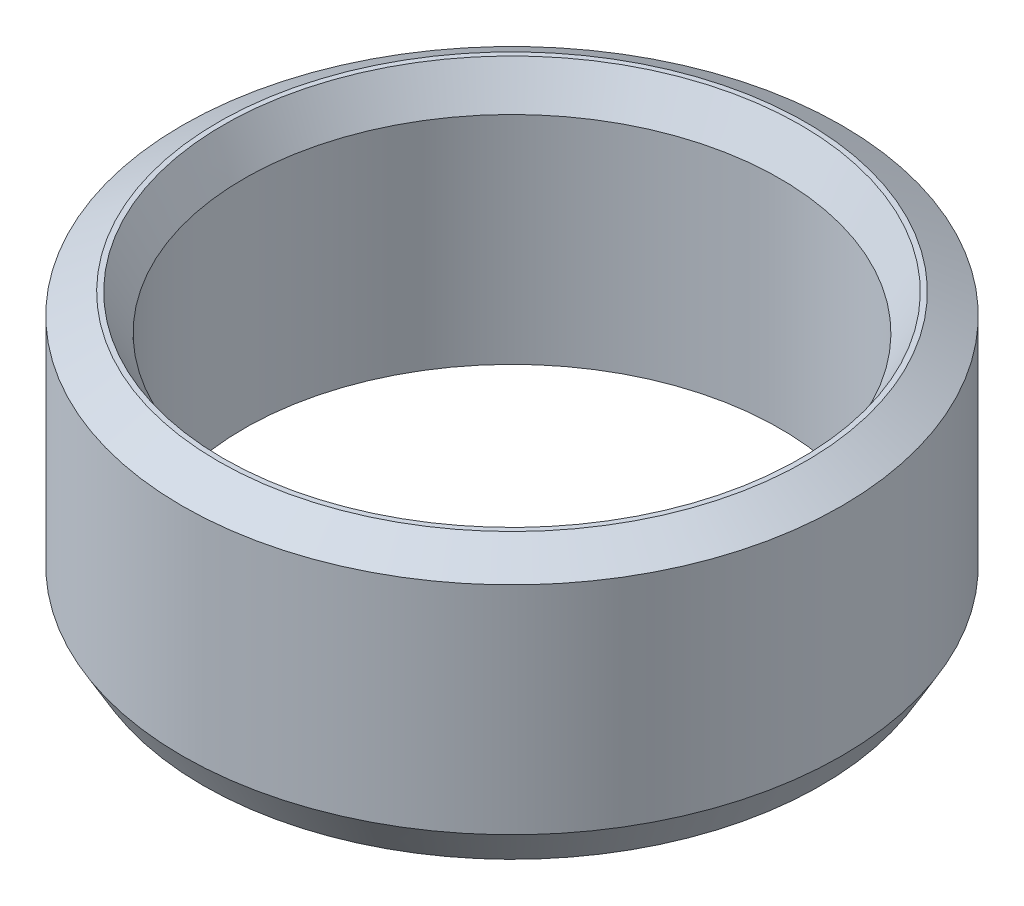
ISO-10303-21;
HEADER;
FILE_DESCRIPTION(('STEP AP214'),'2;1');
FILE_NAME('part.step','',(''),(''),'','','');
FILE_SCHEMA(('AUTOMOTIVE_DESIGN { 1 0 10303 214 1 1 1 1 }'));
ENDSEC;
DATA;
#1=APPLICATION_CONTEXT('core data for automotive mechanical design processes');
#2=APPLICATION_PROTOCOL_DEFINITION('international standard','automotive_design',2000,#1);
#3=PRODUCT_CONTEXT('',#1,'mechanical');
#4=PRODUCT('Part','Part','',(#3));
#5=PRODUCT_RELATED_PRODUCT_CATEGORY('part','',(#4));
#6=PRODUCT_DEFINITION_FORMATION('','',#4);
#7=PRODUCT_DEFINITION_CONTEXT('part definition',#1,'design');
#8=PRODUCT_DEFINITION('design','',#6,#7);
#9=PRODUCT_DEFINITION_SHAPE('','',#8);
#10=(LENGTH_UNIT() NAMED_UNIT(*) SI_UNIT(.MILLI.,.METRE.));
#11=(NAMED_UNIT(*) PLANE_ANGLE_UNIT() SI_UNIT($,.RADIAN.));
#12=(NAMED_UNIT(*) SI_UNIT($,.STERADIAN.) SOLID_ANGLE_UNIT());
#13=UNCERTAINTY_MEASURE_WITH_UNIT(LENGTH_MEASURE(1.E-05),#10,'distance_accuracy_value','');
#14=(GEOMETRIC_REPRESENTATION_CONTEXT(3) GLOBAL_UNCERTAINTY_ASSIGNED_CONTEXT((#13)) GLOBAL_UNIT_ASSIGNED_CONTEXT((#10,
#11,#12)) REPRESENTATION_CONTEXT('',''));
#15=CARTESIAN_POINT('',(0.,0.,0.));
#16=DIRECTION('',(0.,0.,1.));
#17=DIRECTION('',(1.,0.,0.));
#18=AXIS2_PLACEMENT_3D('',#15,#16,#17);
#19=CARTESIAN_POINT('',(0.,22.7844004385805,0.));
#20=DIRECTION('',(0.,-1.,0.));
#21=DIRECTION('',(0.,0.,-1.));
#22=AXIS2_PLACEMENT_3D('',#19,#20,#21);
#23=CYLINDRICAL_SURFACE('',#22,27.5);
#24=CARTESIAN_POINT('',(0.,3.00071029770119,0.));
#25=DIRECTION('',(0.,1.,0.));
#26=DIRECTION('',(0.,0.,1.));
#27=AXIS2_PLACEMENT_3D('',#24,#25,#26);
#28=CIRCLE('',#27,27.5);
#29=CARTESIAN_POINT('',(0.,3.00071029770119,27.5));
#30=VERTEX_POINT('',#29);
#31=EDGE_CURVE('E10',#30,#30,#28,.T.);
#32=ORIENTED_EDGE('',*,*,#31,.T.);
#33=EDGE_LOOP('',(#32));
#34=FACE_BOUND('',#33,.T.);
#35=CARTESIAN_POINT('',(0.,21.0519395404426,0.));
#36=DIRECTION('',(0.,1.,0.));
#37=DIRECTION('',(0.,0.,1.));
#38=AXIS2_PLACEMENT_3D('',#35,#36,#37);
#39=CIRCLE('',#38,27.5);
#40=CARTESIAN_POINT('',(0.,21.0519395404426,27.5));
#41=VERTEX_POINT('',#40);
#42=EDGE_CURVE('E50',#41,#41,#39,.F.);
#43=ORIENTED_EDGE('',*,*,#42,.T.);
#44=EDGE_LOOP('',(#43));
#45=FACE_BOUND('',#44,.T.);
#46=ADVANCED_FACE('F39',(#34,#45),#23,.T.);
#47=CARTESIAN_POINT('',(0.,22.7844004385805,0.));
#48=DIRECTION('',(0.,1.,0.));
#49=DIRECTION('',(0.,0.,1.));
#50=AXIS2_PLACEMENT_3D('',#47,#48,#49);
#51=PLANE('',#50);
#52=CARTESIAN_POINT('',(0.,22.7844004385805,0.));
#53=DIRECTION('',(0.,1.,0.));
#54=DIRECTION('',(0.,0.,1.));
#55=AXIS2_PLACEMENT_3D('',#52,#53,#54);
#56=CIRCLE('',#55,24.0819460958039);
#57=CARTESIAN_POINT('',(0.,22.7844004385805,24.0819460958039));
#58=VERTEX_POINT('',#57);
#59=EDGE_CURVE('E58',#58,#58,#56,.F.);
#60=ORIENTED_EDGE('',*,*,#59,.T.);
#61=EDGE_LOOP('',(#60));
#62=FACE_BOUND('',#61,.T.);
#63=CARTESIAN_POINT('',(0.,22.7844004385805,0.));
#64=DIRECTION('',(0.,1.,0.));
#65=DIRECTION('',(0.,0.,1.));
#66=AXIS2_PLACEMENT_3D('',#63,#64,#65);
#67=CIRCLE('',#66,24.4992897022988);
#68=CARTESIAN_POINT('',(0.,22.7844004385805,24.4992897022988));
#69=VERTEX_POINT('',#68);
#70=EDGE_CURVE('E61',#69,#69,#67,.T.);
#71=ORIENTED_EDGE('',*,*,#70,.T.);
#72=EDGE_LOOP('',(#71));
#73=FACE_BOUND('',#72,.T.);
#74=ADVANCED_FACE('F88',(#62,#73),#51,.T.);
#75=CARTESIAN_POINT('',(0.,0.,0.));
#76=DIRECTION('',(0.,1.,0.));
#77=DIRECTION('',(0.,0.,1.));
#78=AXIS2_PLACEMENT_3D('',#75,#76,#77);
#79=PLANE('',#78);
#80=CARTESIAN_POINT('',(0.,0.,0.));
#81=DIRECTION('',(0.,1.,0.));
#82=DIRECTION('',(0.,0.,1.));
#83=AXIS2_PLACEMENT_3D('',#80,#81,#82);
#84=CIRCLE('',#83,25.3501954953673);
#85=CARTESIAN_POINT('',(0.,0.,25.3501954953673));
#86=VERTEX_POINT('',#85);
#87=EDGE_CURVE('E51',#86,#86,#84,.T.);
#88=ORIENTED_EDGE('',*,*,#87,.T.);
#89=EDGE_LOOP('',(#88));
#90=FACE_BOUND('',#89,.T.);
#91=CARTESIAN_POINT('',(0.,0.,0.));
#92=DIRECTION('',(0.,1.,0.));
#93=DIRECTION('',(0.,0.,1.));
#94=AXIS2_PLACEMENT_3D('',#91,#92,#93);
#95=CIRCLE('',#94,25.7675391018621);
#96=CARTESIAN_POINT('',(0.,0.,25.7675391018621));
#97=VERTEX_POINT('',#96);
#98=EDGE_CURVE('E54',#97,#97,#95,.F.);
#99=ORIENTED_EDGE('',*,*,#98,.T.);
#100=EDGE_LOOP('',(#99));
#101=FACE_BOUND('',#100,.T.);
#102=ADVANCED_FACE('F83',(#90,#101),#79,.F.);
#103=CARTESIAN_POINT('',(0.,22.7844004385805,0.));
#104=DIRECTION('',(0.,-1.,0.));
#105=DIRECTION('',(0.,0.,-1.));
#106=AXIS2_PLACEMENT_3D('',#103,#104,#105);
#107=CYLINDRICAL_SURFACE('',#106,22.3494851976661);
#108=CARTESIAN_POINT('',(0.,19.7836901408793,0.));
#109=DIRECTION('',(0.,1.,0.));
#110=DIRECTION('',(0.,0.,1.));
#111=AXIS2_PLACEMENT_3D('',#108,#109,#110);
#112=CIRCLE('',#111,22.3494851976661);
#113=CARTESIAN_POINT('',(0.,19.7836901408793,22.3494851976661));
#114=VERTEX_POINT('',#113);
#115=EDGE_CURVE('E67',#114,#114,#112,.T.);
#116=ORIENTED_EDGE('',*,*,#115,.T.);
#117=EDGE_LOOP('',(#116));
#118=FACE_BOUND('',#117,.T.);
#119=CARTESIAN_POINT('',(0.,1.73246089813787,0.));
#120=DIRECTION('',(0.,1.,0.));
#121=DIRECTION('',(0.,0.,1.));
#122=AXIS2_PLACEMENT_3D('',#119,#120,#121);
#123=CIRCLE('',#122,22.3494851976661);
#124=CARTESIAN_POINT('',(0.,1.73246089813787,22.3494851976661));
#125=VERTEX_POINT('',#124);
#126=EDGE_CURVE('E69',#125,#125,#123,.F.);
#127=ORIENTED_EDGE('',*,*,#126,.T.);
#128=EDGE_LOOP('',(#127));
#129=FACE_BOUND('',#128,.T.);
#130=ADVANCED_FACE('F71',(#118,#129),#107,.F.);
#131=CARTESIAN_POINT('',(0.,19.7836901408793,0.));
#132=DIRECTION('',(0.,1.,0.));
#133=DIRECTION('',(0.,0.,1.));
#134=AXIS2_PLACEMENT_3D('',#131,#132,#133);
#135=CONICAL_SURFACE('',#134,22.3494851976661,0.523598775598303);
#136=CARTESIAN_POINT('',(0.,22.7844004385805,24.0819460958039));
#137=CARTESIAN_POINT('',(0.,22.7531430396461,24.063899628115));
#138=CARTESIAN_POINT('',(0.,22.7218856407117,24.0458531604261));
#139=CARTESIAN_POINT('',(0.,22.659370842843,24.0097602250482));
#140=CARTESIAN_POINT('',(0.,22.6281134439086,23.9917137573593));
#141=CARTESIAN_POINT('',(0.,22.5655986460398,23.9556208219814));
#142=CARTESIAN_POINT('',(0.,22.5343412471054,23.9375743542925));
#143=CARTESIAN_POINT('',(0.,22.4718264492366,23.9014814189146));
#144=CARTESIAN_POINT('',(0.,22.4405690503022,23.8834349512257));
#145=CARTESIAN_POINT('',(0.,22.3780542524335,23.8473420158478));
#146=CARTESIAN_POINT('',(0.,22.3467968534991,23.8292955481588));
#147=CARTESIAN_POINT('',(0.,22.2842820556303,23.793202612781));
#148=CARTESIAN_POINT('',(0.,22.2530246566959,23.775156145092));
#149=CARTESIAN_POINT('',(0.,22.1905098588271,23.7390632097142));
#150=CARTESIAN_POINT('',(0.,22.1592524598928,23.7210167420252));
#151=CARTESIAN_POINT('',(0.,22.096737662024,23.6849238066474));
#152=CARTESIAN_POINT('',(0.,22.0654802630896,23.6668773389584));
#153=CARTESIAN_POINT('',(0.,22.0029654652208,23.6307844035805));
#154=CARTESIAN_POINT('',(0.,21.9717080662864,23.6127379358916));
#155=CARTESIAN_POINT('',(0.,21.9091932684177,23.5766450005137));
#156=CARTESIAN_POINT('',(0.,21.8779358694833,23.5585985328248));
#157=CARTESIAN_POINT('',(0.,21.8154210716145,23.5225055974469));
#158=CARTESIAN_POINT('',(0.,21.7841636726801,23.504459129758));
#159=CARTESIAN_POINT('',(0.,21.7216488748113,23.4683661943801));
#160=CARTESIAN_POINT('',(0.,21.690391475877,23.4503197266912));
#161=CARTESIAN_POINT('',(0.,21.6278766780082,23.4142267913133));
#162=CARTESIAN_POINT('',(0.,21.5966192790738,23.3961803236244));
#163=CARTESIAN_POINT('',(0.,21.534104481205,23.3600873882465));
#164=CARTESIAN_POINT('',(0.,21.5028470822706,23.3420409205576));
#165=CARTESIAN_POINT('',(0.,21.4403322844019,23.3059479851797));
#166=CARTESIAN_POINT('',(0.,21.4090748854675,23.2879015174908));
#167=CARTESIAN_POINT('',(0.,21.3465600875987,23.2518085821129));
#168=CARTESIAN_POINT('',(0.,21.3153026886643,23.233762114424));
#169=CARTESIAN_POINT('',(0.,21.2527878907955,23.1976691790461));
#170=CARTESIAN_POINT('',(0.,21.2215304918611,23.1796227113571));
#171=CARTESIAN_POINT('',(0.,21.1590156939924,23.1435297759793));
#172=CARTESIAN_POINT('',(0.,21.127758295058,23.1254833082903));
#173=CARTESIAN_POINT('',(0.,21.0652434971892,23.0893903729125));
#174=CARTESIAN_POINT('',(0.,21.0339860982548,23.0713439052235));
#175=CARTESIAN_POINT('',(0.,20.971471300386,23.0352509698457));
#176=CARTESIAN_POINT('',(0.,20.9402139014517,23.0172045021567));
#177=CARTESIAN_POINT('',(0.,20.8776991035829,22.9811115667788));
#178=CARTESIAN_POINT('',(0.,20.8464417046485,22.9630650990899));
#179=CARTESIAN_POINT('',(0.,20.7839269067797,22.926972163712));
#180=CARTESIAN_POINT('',(0.,20.7526695078453,22.9089256960231));
#181=CARTESIAN_POINT('',(0.,20.6901547099766,22.8728327606452));
#182=CARTESIAN_POINT('',(0.,20.6588973110422,22.8547862929563));
#183=CARTESIAN_POINT('',(0.,20.5963825131734,22.8186933575784));
#184=CARTESIAN_POINT('',(0.,20.565125114239,22.8006468898895));
#185=CARTESIAN_POINT('',(0.,20.5026103163702,22.7645539545116));
#186=CARTESIAN_POINT('',(0.,20.4713529174359,22.7465074868227));
#187=CARTESIAN_POINT('',(0.,20.4088381195671,22.7104145514448));
#188=CARTESIAN_POINT('',(0.,20.3775807206327,22.6923680837559));
#189=CARTESIAN_POINT('',(0.,20.3150659227639,22.656275148378));
#190=CARTESIAN_POINT('',(0.,20.2838085238295,22.6382286806891));
#191=CARTESIAN_POINT('',(0.,20.2212937259608,22.6021357453112));
#192=CARTESIAN_POINT('',(0.,20.1900363270264,22.5840892776223));
#193=CARTESIAN_POINT('',(0.,20.1275215291576,22.5479963422444));
#194=CARTESIAN_POINT('',(0.,20.0962641302232,22.5299498745554));
#195=CARTESIAN_POINT('',(0.,20.0337493323544,22.4938569391776));
#196=CARTESIAN_POINT('',(0.,20.0024919334201,22.4758104714886));
#197=CARTESIAN_POINT('',(0.,19.9399771355513,22.4397175361108));
#198=CARTESIAN_POINT('',(0.,19.9087197366169,22.4216710684218));
#199=CARTESIAN_POINT('',(0.,19.8462049387481,22.385578133044));
#200=CARTESIAN_POINT('',(0.,19.8149475398137,22.367531665355));
#201=CARTESIAN_POINT('',(0.,19.7836901408793,22.3494851976661));
#202=B_SPLINE_CURVE_WITH_KNOTS('',3,(#136,#137,#138,#139,#140,#141,#142,#143,#144,#145,#146,
#147,#148,#149,#150,#151,#152,#153,#154,#155,#156,#157,#158,#159,#160,#161,#162,#163,#164,#165,
#166,#167,#168,#169,#170,#171,#172,#173,#174,#175,#176,#177,#178,#179,#180,#181,#182,#183,#184,
#185,#186,#187,#188,#189,#190,#191,#192,#193,#194,#195,#196,#197,#198,#199,#200,#201),
.UNSPECIFIED.,.F.,.F.,(4,2,2,2,2,2,2,2,2,2,2,2,2,2,2,2,2,2,2,2,2,2,2,2,2,2,2,2,2,2,2,2,4),(0.,
0.108278806133618,0.216557612267232,0.324836418400849,0.433115224534462,0.541394030668079,
0.649672836801695,0.757951642935311,0.866230449068925,0.974509255202539,1.08278806133616,
1.19106686746977,1.29934567360339,1.407624479737,1.51590328587062,1.62418209200423,
1.73246089813785,1.84073970427146,1.94901851040508,2.05729731653869,2.16557612267231,
2.27385492880593,2.38213373493954,2.49041254107316,2.59869134720677,2.70697015334039,
2.815248959474,2.92352776560762,3.03180657174123,3.14008537787485,3.24836418400847,
3.35664299014208,3.46492179627569),.UNSPECIFIED.);
#203=EDGE_CURVE('BSEAM77',#58,#114,#202,.T.);
#204=ORIENTED_EDGE('',*,*,#59,.F.);
#205=ORIENTED_EDGE('',*,*,#115,.F.);
#206=ORIENTED_EDGE('',*,*,#203,.T.);
#207=ORIENTED_EDGE('',*,*,#203,.F.);
#208=EDGE_LOOP('',(#204,#206,#205,#207));
#209=FACE_BOUND('',#208,.T.);
#210=ADVANCED_FACE('F77',(#209),#135,.F.);
#211=CARTESIAN_POINT('',(0.,0.,0.));
#212=DIRECTION('',(0.,-1.,0.));
#213=DIRECTION('',(0.,0.,-1.));
#214=AXIS2_PLACEMENT_3D('',#211,#212,#213);
#215=CONICAL_SURFACE('',#214,25.3501954953673,1.04719755119659);
#216=ORIENTED_EDGE('',*,*,#126,.F.);
#217=EDGE_LOOP('',(#216));
#218=FACE_BOUND('',#217,.T.);
#219=ORIENTED_EDGE('',*,*,#87,.F.);
#220=EDGE_LOOP('',(#219));
#221=FACE_BOUND('',#220,.T.);
#222=ADVANCED_FACE('F73',(#218,#221),#215,.F.);
#223=CARTESIAN_POINT('',(0.,3.00071029770119,0.));
#224=DIRECTION('',(0.,1.,0.));
#225=DIRECTION('',(0.,0.,1.));
#226=AXIS2_PLACEMENT_3D('',#223,#224,#225);
#227=CONICAL_SURFACE('',#226,27.5,0.523598775598303);
#228=ORIENTED_EDGE('',*,*,#98,.F.);
#229=EDGE_LOOP('',(#228));
#230=FACE_BOUND('',#229,.T.);
#231=ORIENTED_EDGE('',*,*,#31,.F.);
#232=EDGE_LOOP('',(#231));
#233=FACE_BOUND('',#232,.T.);
#234=ADVANCED_FACE('F76',(#230,#233),#227,.T.);
#235=CARTESIAN_POINT('',(0.,22.7844004385805,0.));
#236=DIRECTION('',(0.,-1.,0.));
#237=DIRECTION('',(0.,0.,-1.));
#238=AXIS2_PLACEMENT_3D('',#235,#236,#237);
#239=CONICAL_SURFACE('',#238,24.4992897022988,1.04719755119659);
#240=ORIENTED_EDGE('',*,*,#42,.F.);
#241=EDGE_LOOP('',(#240));
#242=FACE_BOUND('',#241,.T.);
#243=ORIENTED_EDGE('',*,*,#70,.F.);
#244=EDGE_LOOP('',(#243));
#245=FACE_BOUND('',#244,.T.);
#246=ADVANCED_FACE('F45',(#242,#245),#239,.T.);
#247=CLOSED_SHELL('',(#46,#74,#102,#130,#210,#222,#234,#246));
#248=MANIFOLD_SOLID_BREP('B2',#247);
#249=ADVANCED_BREP_SHAPE_REPRESENTATION('',(#18,#248),#14);
#250=SHAPE_DEFINITION_REPRESENTATION(#9,#249);
ENDSEC;
END-ISO-10303-21;
